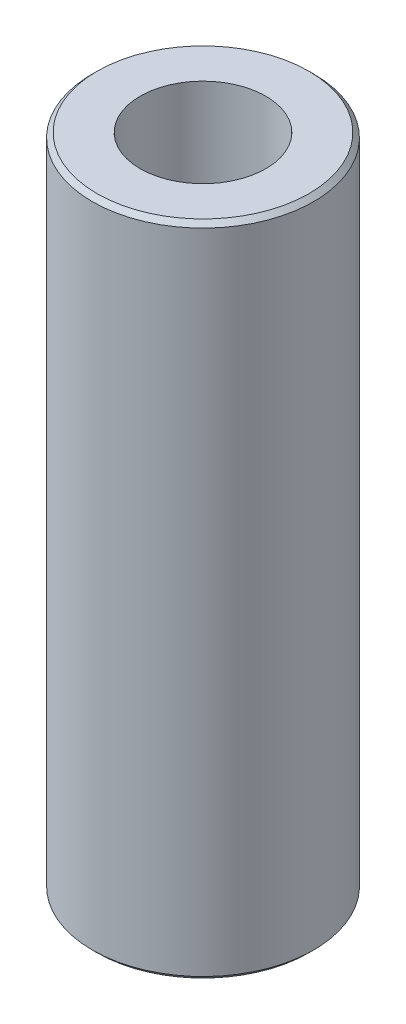
ISO-10303-21;
HEADER;
FILE_DESCRIPTION(('STEP AP214'),'2;1');
FILE_NAME('part.step','',(''),(''),'','','');
FILE_SCHEMA(('AUTOMOTIVE_DESIGN { 1 0 10303 214 1 1 1 1 }'));
ENDSEC;
DATA;
#1=APPLICATION_CONTEXT('core data for automotive mechanical design processes');
#2=APPLICATION_PROTOCOL_DEFINITION('international standard','automotive_design',2000,#1);
#3=PRODUCT_CONTEXT('',#1,'mechanical');
#4=PRODUCT('Part','Part','',(#3));
#5=PRODUCT_RELATED_PRODUCT_CATEGORY('part','',(#4));
#6=PRODUCT_DEFINITION_FORMATION('','',#4);
#7=PRODUCT_DEFINITION_CONTEXT('part definition',#1,'design');
#8=PRODUCT_DEFINITION('design','',#6,#7);
#9=PRODUCT_DEFINITION_SHAPE('','',#8);
#10=(LENGTH_UNIT() NAMED_UNIT(*) SI_UNIT(.MILLI.,.METRE.));
#11=(NAMED_UNIT(*) PLANE_ANGLE_UNIT() SI_UNIT($,.RADIAN.));
#12=(NAMED_UNIT(*) SI_UNIT($,.STERADIAN.) SOLID_ANGLE_UNIT());
#13=UNCERTAINTY_MEASURE_WITH_UNIT(LENGTH_MEASURE(1.E-05),#10,'distance_accuracy_value','');
#14=(GEOMETRIC_REPRESENTATION_CONTEXT(3) GLOBAL_UNCERTAINTY_ASSIGNED_CONTEXT((#13)) GLOBAL_UNIT_ASSIGNED_CONTEXT((#10,
#11,#12)) REPRESENTATION_CONTEXT('',''));
#15=CARTESIAN_POINT('',(0.,0.,0.));
#16=DIRECTION('',(0.,0.,1.));
#17=DIRECTION('',(1.,0.,0.));
#18=AXIS2_PLACEMENT_3D('',#15,#16,#17);
#19=CARTESIAN_POINT('',(0.,193.108476640798,0.));
#20=DIRECTION('',(0.,-1.,0.));
#21=DIRECTION('',(0.,0.,-1.));
#22=AXIS2_PLACEMENT_3D('',#19,#20,#21);
#23=CYLINDRICAL_SURFACE('',#22,32.5);
#24=CARTESIAN_POINT('',(0.,191.742790487967,0.));
#25=DIRECTION('',(0.,1.,0.));
#26=DIRECTION('',(0.,0.,1.));
#27=AXIS2_PLACEMENT_3D('',#24,#25,#26);
#28=CIRCLE('',#27,32.5);
#29=CARTESIAN_POINT('',(0.,191.742790487967,32.5));
#30=VERTEX_POINT('',#29);
#31=EDGE_CURVE('E50',#30,#30,#28,.F.);
#32=ORIENTED_EDGE('',*,*,#31,.T.);
#33=EDGE_LOOP('',(#32));
#34=FACE_BOUND('',#33,.T.);
#35=CARTESIAN_POINT('',(0.,1.36568615283056,0.));
#36=DIRECTION('',(0.,1.,0.));
#37=DIRECTION('',(0.,0.,1.));
#38=AXIS2_PLACEMENT_3D('',#35,#36,#37);
#39=CIRCLE('',#38,32.5);
#40=CARTESIAN_POINT('',(0.,1.36568615283056,32.5));
#41=VERTEX_POINT('',#40);
#42=EDGE_CURVE('E51',#41,#41,#39,.T.);
#43=ORIENTED_EDGE('',*,*,#42,.T.);
#44=EDGE_LOOP('',(#43));
#45=FACE_BOUND('',#44,.T.);
#46=ADVANCED_FACE('F39',(#34,#45),#23,.T.);
#47=CARTESIAN_POINT('',(0.,193.108476640798,0.));
#48=DIRECTION('',(0.,1.,0.));
#49=DIRECTION('',(0.,0.,1.));
#50=AXIS2_PLACEMENT_3D('',#47,#48,#49);
#51=PLANE('',#50);
#52=CARTESIAN_POINT('',(0.,193.108476640798,0.));
#53=DIRECTION('',(0.,1.,0.));
#54=DIRECTION('',(0.,0.,1.));
#55=AXIS2_PLACEMENT_3D('',#52,#53,#54);
#56=CIRCLE('',#55,31.1343138471694);
#57=CARTESIAN_POINT('',(0.,193.108476640798,31.1343138471694));
#58=VERTEX_POINT('',#57);
#59=EDGE_CURVE('E54',#58,#58,#56,.T.);
#60=ORIENTED_EDGE('',*,*,#59,.T.);
#61=EDGE_LOOP('',(#60));
#62=FACE_BOUND('',#61,.T.);
#63=CARTESIAN_POINT('',(0.,193.108476640798,0.));
#64=DIRECTION('',(0.,1.,0.));
#65=DIRECTION('',(0.,0.,1.));
#66=AXIS2_PLACEMENT_3D('',#63,#64,#65);
#67=CIRCLE('',#66,18.4602301366897);
#68=CARTESIAN_POINT('',(0.,193.108476640798,18.4602301366897));
#69=VERTEX_POINT('',#68);
#70=EDGE_CURVE('E58',#69,#69,#67,.T.);
#71=ORIENTED_EDGE('',*,*,#70,.F.);
#72=EDGE_LOOP('',(#71));
#73=FACE_BOUND('',#72,.T.);
#74=ADVANCED_FACE('F69',(#62,#73),#51,.T.);
#75=CARTESIAN_POINT('',(0.,0.,0.));
#76=DIRECTION('',(0.,1.,0.));
#77=DIRECTION('',(0.,0.,1.));
#78=AXIS2_PLACEMENT_3D('',#75,#76,#77);
#79=PLANE('',#78);
#80=CARTESIAN_POINT('',(0.,0.,0.));
#81=DIRECTION('',(0.,1.,0.));
#82=DIRECTION('',(0.,0.,1.));
#83=AXIS2_PLACEMENT_3D('',#80,#81,#82);
#84=CIRCLE('',#83,31.1343138471694);
#85=CARTESIAN_POINT('',(0.,0.,31.1343138471694));
#86=VERTEX_POINT('',#85);
#87=EDGE_CURVE('E10',#86,#86,#84,.F.);
#88=ORIENTED_EDGE('',*,*,#87,.T.);
#89=EDGE_LOOP('',(#88));
#90=FACE_BOUND('',#89,.T.);
#91=CARTESIAN_POINT('',(0.,0.,0.));
#92=DIRECTION('',(0.,1.,0.));
#93=DIRECTION('',(0.,0.,1.));
#94=AXIS2_PLACEMENT_3D('',#91,#92,#93);
#95=CIRCLE('',#94,18.4602301366897);
#96=CARTESIAN_POINT('',(0.,0.,18.4602301366897));
#97=VERTEX_POINT('',#96);
#98=EDGE_CURVE('E63',#97,#97,#95,.T.);
#99=ORIENTED_EDGE('',*,*,#98,.T.);
#100=EDGE_LOOP('',(#99));
#101=FACE_BOUND('',#100,.T.);
#102=ADVANCED_FACE('F75',(#90,#101),#79,.F.);
#103=CARTESIAN_POINT('',(0.,193.108476640798,0.));
#104=DIRECTION('',(0.,-1.,0.));
#105=DIRECTION('',(0.,0.,-1.));
#106=AXIS2_PLACEMENT_3D('',#103,#104,#105);
#107=CYLINDRICAL_SURFACE('',#106,18.4602301366897);
#108=ORIENTED_EDGE('',*,*,#70,.T.);
#109=EDGE_LOOP('',(#108));
#110=FACE_BOUND('',#109,.T.);
#111=ORIENTED_EDGE('',*,*,#98,.F.);
#112=EDGE_LOOP('',(#111));
#113=FACE_BOUND('',#112,.T.);
#114=ADVANCED_FACE('F70',(#110,#113),#107,.F.);
#115=CARTESIAN_POINT('',(0.,193.108476640798,0.));
#116=DIRECTION('',(0.,-1.,0.));
#117=DIRECTION('',(0.,0.,-1.));
#118=AXIS2_PLACEMENT_3D('',#115,#116,#117);
#119=CONICAL_SURFACE('',#118,31.1343138471694,0.785398163397438);
#120=ORIENTED_EDGE('',*,*,#31,.F.);
#121=EDGE_LOOP('',(#120));
#122=FACE_BOUND('',#121,.T.);
#123=ORIENTED_EDGE('',*,*,#59,.F.);
#124=EDGE_LOOP('',(#123));
#125=FACE_BOUND('',#124,.T.);
#126=ADVANCED_FACE('F81',(#122,#125),#119,.T.);
#127=CARTESIAN_POINT('',(0.,1.36568615283056,0.));
#128=DIRECTION('',(0.,1.,0.));
#129=DIRECTION('',(0.,0.,1.));
#130=AXIS2_PLACEMENT_3D('',#127,#128,#129);
#131=CONICAL_SURFACE('',#130,32.5,0.785398163397448);
#132=ORIENTED_EDGE('',*,*,#87,.F.);
#133=EDGE_LOOP('',(#132));
#134=FACE_BOUND('',#133,.T.);
#135=ORIENTED_EDGE('',*,*,#42,.F.);
#136=EDGE_LOOP('',(#135));
#137=FACE_BOUND('',#136,.T.);
#138=ADVANCED_FACE('F45',(#134,#137),#131,.T.);
#139=CLOSED_SHELL('',(#46,#74,#102,#114,#126,#138));
#140=MANIFOLD_SOLID_BREP('B2',#139);
#141=ADVANCED_BREP_SHAPE_REPRESENTATION('',(#18,#140),#14);
#142=SHAPE_DEFINITION_REPRESENTATION(#9,#141);
ENDSEC;
END-ISO-10303-21;
